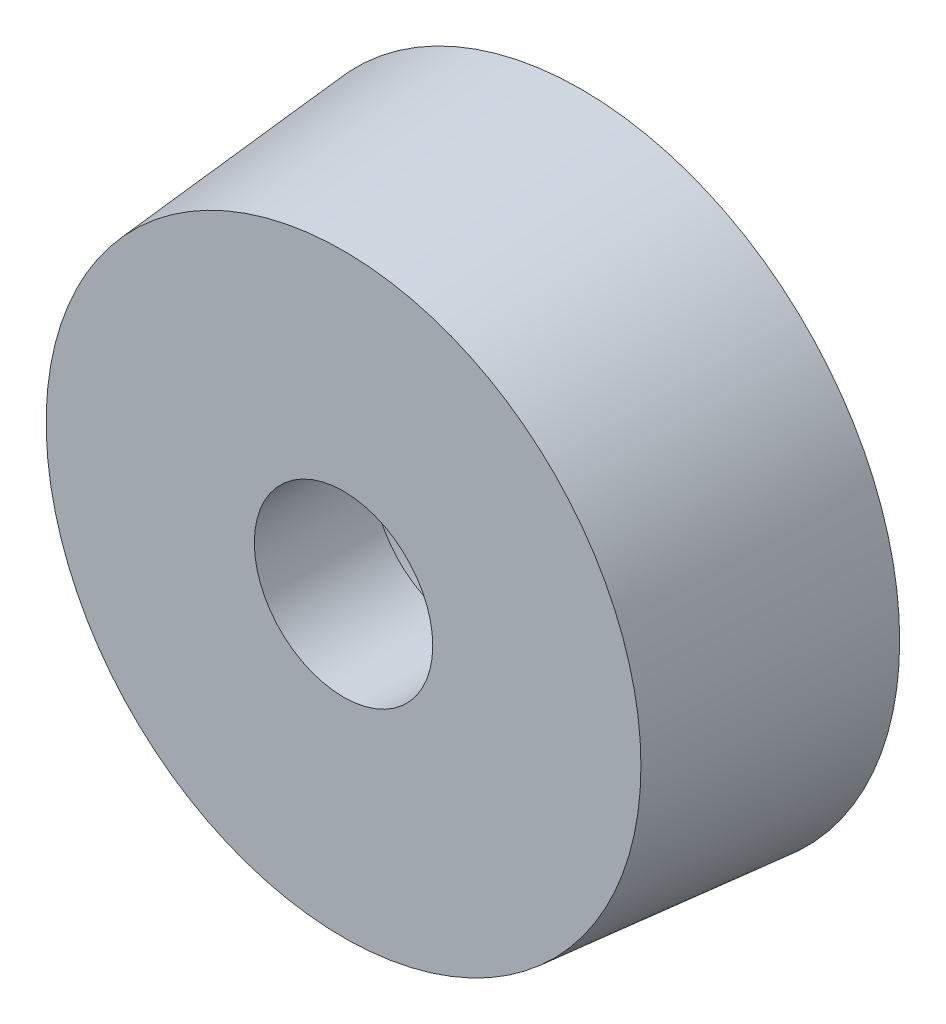
ISO-10303-21;
HEADER;
FILE_DESCRIPTION(('STEP AP214'),'2;1');
FILE_NAME('part.step','',(''),(''),'','','');
FILE_SCHEMA(('AUTOMOTIVE_DESIGN { 1 0 10303 214 1 1 1 1 }'));
ENDSEC;
DATA;
#1=APPLICATION_CONTEXT('core data for automotive mechanical design processes');
#2=APPLICATION_PROTOCOL_DEFINITION('international standard','automotive_design',2000,#1);
#3=PRODUCT_CONTEXT('',#1,'mechanical');
#4=PRODUCT('Part','Part','',(#3));
#5=PRODUCT_RELATED_PRODUCT_CATEGORY('part','',(#4));
#6=PRODUCT_DEFINITION_FORMATION('','',#4);
#7=PRODUCT_DEFINITION_CONTEXT('part definition',#1,'design');
#8=PRODUCT_DEFINITION('design','',#6,#7);
#9=PRODUCT_DEFINITION_SHAPE('','',#8);
#10=(LENGTH_UNIT() NAMED_UNIT(*) SI_UNIT(.MILLI.,.METRE.));
#11=(NAMED_UNIT(*) PLANE_ANGLE_UNIT() SI_UNIT($,.RADIAN.));
#12=(NAMED_UNIT(*) SI_UNIT($,.STERADIAN.) SOLID_ANGLE_UNIT());
#13=UNCERTAINTY_MEASURE_WITH_UNIT(LENGTH_MEASURE(1.E-05),#10,'distance_accuracy_value','');
#14=(GEOMETRIC_REPRESENTATION_CONTEXT(3) GLOBAL_UNCERTAINTY_ASSIGNED_CONTEXT((#13)) GLOBAL_UNIT_ASSIGNED_CONTEXT((#10,
#11,#12)) REPRESENTATION_CONTEXT('',''));
#15=CARTESIAN_POINT('',(0.,0.,0.));
#16=DIRECTION('',(0.,0.,1.));
#17=DIRECTION('',(1.,0.,0.));
#18=AXIS2_PLACEMENT_3D('',#15,#16,#17);
#19=CARTESIAN_POINT('',(0.,0.,8.));
#20=DIRECTION('',(0.,0.,-1.));
#21=DIRECTION('',(-1.,0.,0.));
#22=AXIS2_PLACEMENT_3D('',#19,#20,#21);
#23=CYLINDRICAL_SURFACE('',#22,3.);
#24=CARTESIAN_POINT('',(0.,0.,8.));
#25=DIRECTION('',(0.,0.,1.));
#26=DIRECTION('',(1.,0.,0.));
#27=AXIS2_PLACEMENT_3D('',#24,#25,#26);
#28=CIRCLE('',#27,3.);
#29=CARTESIAN_POINT('',(3.,0.,8.));
#30=VERTEX_POINT('',#29);
#31=EDGE_CURVE('E47',#30,#30,#28,.T.);
#32=ORIENTED_EDGE('',*,*,#31,.T.);
#33=EDGE_LOOP('',(#32));
#34=FACE_BOUND('',#33,.T.);
#35=CARTESIAN_POINT('',(0.,0.,4.));
#36=DIRECTION('',(0.,0.,-1.));
#37=DIRECTION('',(-1.,0.,0.));
#38=AXIS2_PLACEMENT_3D('',#35,#36,#37);
#39=CIRCLE('',#38,3.);
#40=CARTESIAN_POINT('',(-3.,0.,4.));
#41=VERTEX_POINT('',#40);
#42=EDGE_CURVE('E38',#41,#41,#39,.T.);
#43=ORIENTED_EDGE('',*,*,#42,.T.);
#44=EDGE_LOOP('',(#43));
#45=FACE_BOUND('',#44,.T.);
#46=ADVANCED_FACE('F34',(#34,#45),#23,.F.);
#47=CARTESIAN_POINT('',(0.,0.,8.));
#48=DIRECTION('',(0.,0.,1.));
#49=DIRECTION('',(1.,0.,0.));
#50=AXIS2_PLACEMENT_3D('',#47,#48,#49);
#51=PLANE('',#50);
#52=CARTESIAN_POINT('',(0.,0.,8.));
#53=DIRECTION('',(0.,0.,1.));
#54=DIRECTION('',(1.,0.,0.));
#55=AXIS2_PLACEMENT_3D('',#52,#53,#54);
#56=CIRCLE('',#55,10.);
#57=CARTESIAN_POINT('',(10.,0.,8.));
#58=VERTEX_POINT('',#57);
#59=EDGE_CURVE('E10',#58,#58,#56,.T.);
#60=ORIENTED_EDGE('',*,*,#59,.T.);
#61=EDGE_LOOP('',(#60));
#62=FACE_BOUND('',#61,.T.);
#63=ORIENTED_EDGE('',*,*,#31,.F.);
#64=EDGE_LOOP('',(#63));
#65=FACE_BOUND('',#64,.T.);
#66=ADVANCED_FACE('F72',(#62,#65),#51,.T.);
#67=CARTESIAN_POINT('',(0.,0.,0.));
#68=DIRECTION('',(0.,0.,1.));
#69=DIRECTION('',(1.,0.,0.));
#70=AXIS2_PLACEMENT_3D('',#67,#68,#69);
#71=PLANE('',#70);
#72=CARTESIAN_POINT('',(0.,0.,0.));
#73=DIRECTION('',(0.,0.,-1.));
#74=DIRECTION('',(-1.,0.,0.));
#75=AXIS2_PLACEMENT_3D('',#72,#73,#74);
#76=CIRCLE('',#75,6.);
#77=CARTESIAN_POINT('',(-6.,0.,0.));
#78=VERTEX_POINT('',#77);
#79=EDGE_CURVE('E51',#78,#78,#76,.T.);
#80=ORIENTED_EDGE('',*,*,#79,.F.);
#81=EDGE_LOOP('',(#80));
#82=FACE_BOUND('',#81,.T.);
#83=CARTESIAN_POINT('',(0.,0.,0.));
#84=DIRECTION('',(0.,0.,1.));
#85=DIRECTION('',(1.,0.,0.));
#86=AXIS2_PLACEMENT_3D('',#83,#84,#85);
#87=CIRCLE('',#86,10.6999093082074);
#88=CARTESIAN_POINT('',(10.6999093082074,0.,0.));
#89=VERTEX_POINT('',#88);
#90=EDGE_CURVE('E42',#89,#89,#87,.T.);
#91=ORIENTED_EDGE('',*,*,#90,.F.);
#92=EDGE_LOOP('',(#91));
#93=FACE_BOUND('',#92,.T.);
#94=ADVANCED_FACE('F78',(#82,#93),#71,.F.);
#95=CARTESIAN_POINT('',(0.,0.,8.));
#96=DIRECTION('',(0.,0.,-1.));
#97=DIRECTION('',(1.,0.,0.));
#98=AXIS2_PLACEMENT_3D('',#95,#96,#97);
#99=CONICAL_SURFACE('',#98,10.,0.0872664625997167);
#100=ORIENTED_EDGE('',*,*,#59,.F.);
#101=EDGE_LOOP('',(#100));
#102=FACE_BOUND('',#101,.T.);
#103=ORIENTED_EDGE('',*,*,#90,.T.);
#104=EDGE_LOOP('',(#103));
#105=FACE_BOUND('',#104,.T.);
#106=ADVANCED_FACE('F36',(#102,#105),#99,.T.);
#107=CARTESIAN_POINT('',(0.,0.,4.));
#108=DIRECTION('',(0.,0.,-1.));
#109=DIRECTION('',(-1.,0.,0.));
#110=AXIS2_PLACEMENT_3D('',#107,#108,#109);
#111=CYLINDRICAL_SURFACE('',#110,6.);
#112=CARTESIAN_POINT('',(0.,0.,4.));
#113=DIRECTION('',(0.,0.,-1.));
#114=DIRECTION('',(-1.,0.,0.));
#115=AXIS2_PLACEMENT_3D('',#112,#113,#114);
#116=CIRCLE('',#115,6.);
#117=CARTESIAN_POINT('',(-6.,0.,4.));
#118=VERTEX_POINT('',#117);
#119=EDGE_CURVE('E54',#118,#118,#116,.T.);
#120=ORIENTED_EDGE('',*,*,#119,.F.);
#121=EDGE_LOOP('',(#120));
#122=FACE_BOUND('',#121,.T.);
#123=ORIENTED_EDGE('',*,*,#79,.T.);
#124=EDGE_LOOP('',(#123));
#125=FACE_BOUND('',#124,.T.);
#126=ADVANCED_FACE('F64',(#122,#125),#111,.F.);
#127=CARTESIAN_POINT('',(0.,0.,4.));
#128=DIRECTION('',(0.,0.,-1.));
#129=DIRECTION('',(-1.,0.,0.));
#130=AXIS2_PLACEMENT_3D('',#127,#128,#129);
#131=PLANE('',#130);
#132=ORIENTED_EDGE('',*,*,#42,.F.);
#133=EDGE_LOOP('',(#132));
#134=FACE_BOUND('',#133,.T.);
#135=ORIENTED_EDGE('',*,*,#119,.T.);
#136=EDGE_LOOP('',(#135));
#137=FACE_BOUND('',#136,.T.);
#138=ADVANCED_FACE('F62',(#134,#137),#131,.T.);
#139=CLOSED_SHELL('',(#46,#66,#94,#106,#126,#138));
#140=MANIFOLD_SOLID_BREP('B2',#139);
#141=ADVANCED_BREP_SHAPE_REPRESENTATION('',(#18,#140),#14);
#142=SHAPE_DEFINITION_REPRESENTATION(#9,#141);
ENDSEC;
END-ISO-10303-21;
